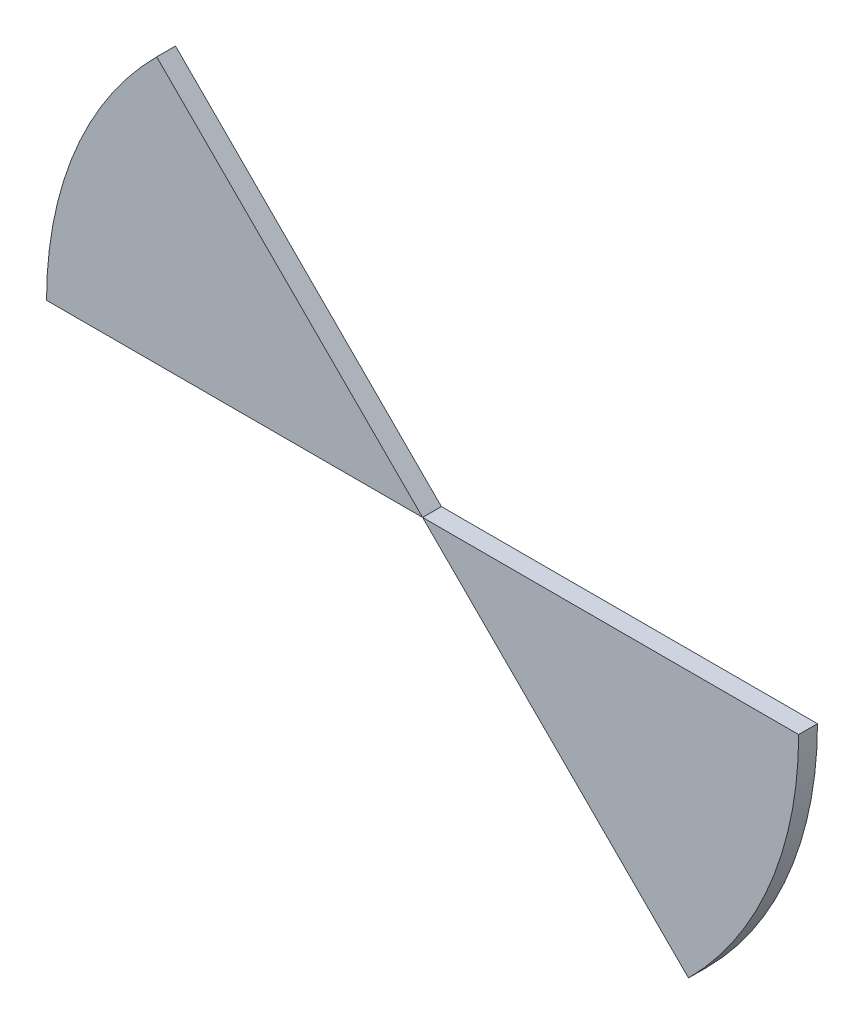
ISO-10303-21;
HEADER;
FILE_DESCRIPTION(('STEP AP214'),'2;1');
FILE_NAME('part.step','',(''),(''),'','','');
FILE_SCHEMA(('AUTOMOTIVE_DESIGN { 1 0 10303 214 1 1 1 1 }'));
ENDSEC;
DATA;
#1=APPLICATION_CONTEXT('core data for automotive mechanical design processes');
#2=APPLICATION_PROTOCOL_DEFINITION('international standard','automotive_design',2000,#1);
#3=PRODUCT_CONTEXT('',#1,'mechanical');
#4=PRODUCT('Part','Part','',(#3));
#5=PRODUCT_RELATED_PRODUCT_CATEGORY('part','',(#4));
#6=PRODUCT_DEFINITION_FORMATION('','',#4);
#7=PRODUCT_DEFINITION_CONTEXT('part definition',#1,'design');
#8=PRODUCT_DEFINITION('design','',#6,#7);
#9=PRODUCT_DEFINITION_SHAPE('','',#8);
#10=(LENGTH_UNIT() NAMED_UNIT(*) SI_UNIT(.MILLI.,.METRE.));
#11=(NAMED_UNIT(*) PLANE_ANGLE_UNIT() SI_UNIT($,.RADIAN.));
#12=(NAMED_UNIT(*) SI_UNIT($,.STERADIAN.) SOLID_ANGLE_UNIT());
#13=UNCERTAINTY_MEASURE_WITH_UNIT(LENGTH_MEASURE(1.E-05),#10,'distance_accuracy_value','');
#14=(GEOMETRIC_REPRESENTATION_CONTEXT(3) GLOBAL_UNCERTAINTY_ASSIGNED_CONTEXT((#13)) GLOBAL_UNIT_ASSIGNED_CONTEXT((#10,
#11,#12)) REPRESENTATION_CONTEXT('',''));
#15=CARTESIAN_POINT('',(0.,0.,0.));
#16=DIRECTION('',(0.,0.,1.));
#17=DIRECTION('',(1.,0.,0.));
#18=AXIS2_PLACEMENT_3D('',#15,#16,#17);
#19=CARTESIAN_POINT('',(100.,0.,127.474487139159));
#20=DIRECTION('',(0.,-1.,0.));
#21=DIRECTION('',(0.,0.,-1.));
#22=AXIS2_PLACEMENT_3D('',#19,#20,#21);
#23=PLANE('',#22);
#24=DIRECTION('',(-1.,0.,0.));
#25=VECTOR('',#24,1.);
#26=CARTESIAN_POINT('',(100.,0.,5.));
#27=LINE('',#26,#25);
#28=CARTESIAN_POINT('',(100.,0.,5.));
#29=VERTEX_POINT('',#28);
#30=CARTESIAN_POINT('',(0.,0.,5.));
#31=VERTEX_POINT('',#30);
#32=EDGE_CURVE('E58',#29,#31,#27,.T.);
#33=ORIENTED_EDGE('',*,*,#32,.F.);
#34=DIRECTION('',(0.,0.,-1.));
#35=VECTOR('',#34,1.);
#36=CARTESIAN_POINT('',(100.,0.,127.474487139159));
#37=LINE('',#36,#35);
#38=CARTESIAN_POINT('',(100.,0.,0.));
#39=VERTEX_POINT('',#38);
#40=EDGE_CURVE('E54',#29,#39,#37,.T.);
#41=ORIENTED_EDGE('',*,*,#40,.T.);
#42=DIRECTION('',(-1.,0.,0.));
#43=VECTOR('',#42,1.);
#44=CARTESIAN_POINT('',(100.,0.,0.));
#45=LINE('',#44,#43);
#46=CARTESIAN_POINT('',(0.,0.,0.));
#47=VERTEX_POINT('',#46);
#48=EDGE_CURVE('E89',#39,#47,#45,.T.);
#49=ORIENTED_EDGE('',*,*,#48,.T.);
#50=DIRECTION('',(0.,0.,-1.));
#51=VECTOR('',#50,1.);
#52=CARTESIAN_POINT('',(0.,0.,127.474487139159));
#53=LINE('',#52,#51);
#54=EDGE_CURVE('E81',#31,#47,#53,.T.);
#55=ORIENTED_EDGE('',*,*,#54,.F.);
#56=EDGE_LOOP('',(#33,#41,#49,#55));
#57=FACE_BOUND('',#56,.T.);
#58=ADVANCED_FACE('F51',(#57),#23,.F.);
#59=CARTESIAN_POINT('',(0.,0.,127.474487139159));
#60=DIRECTION('',(0.707106781186544,0.707106781186551,0.));
#61=DIRECTION('',(-0.707106781186551,0.707106781186544,0.));
#62=AXIS2_PLACEMENT_3D('',#59,#60,#61);
#63=PLANE('',#62);
#64=DIRECTION('',(0.707106781186551,-0.707106781186544,0.));
#65=VECTOR('',#64,1.);
#66=CARTESIAN_POINT('',(0.,0.,5.));
#67=LINE('',#66,#65);
#68=CARTESIAN_POINT('',(70.7106781186551,-70.7106781186544,5.));
#69=VERTEX_POINT('',#68);
#70=EDGE_CURVE('E12',#31,#69,#67,.T.);
#71=ORIENTED_EDGE('',*,*,#70,.F.);
#72=ORIENTED_EDGE('',*,*,#54,.T.);
#73=DIRECTION('',(0.707106781186551,-0.707106781186544,0.));
#74=VECTOR('',#73,1.);
#75=CARTESIAN_POINT('',(0.,0.,0.));
#76=LINE('',#75,#74);
#77=CARTESIAN_POINT('',(70.7106781186551,-70.7106781186544,0.));
#78=VERTEX_POINT('',#77);
#79=EDGE_CURVE('E99',#47,#78,#76,.T.);
#80=ORIENTED_EDGE('',*,*,#79,.T.);
#81=DIRECTION('',(0.,0.,-1.));
#82=VECTOR('',#81,1.);
#83=CARTESIAN_POINT('',(70.7106781186551,-70.7106781186544,127.474487139159));
#84=LINE('',#83,#82);
#85=EDGE_CURVE('E71',#69,#78,#84,.T.);
#86=ORIENTED_EDGE('',*,*,#85,.F.);
#87=EDGE_LOOP('',(#71,#72,#80,#86));
#88=FACE_BOUND('',#87,.T.);
#89=ADVANCED_FACE('F106',(#88),#63,.F.);
#90=CARTESIAN_POINT('',(0.,0.,127.474487139159));
#91=DIRECTION('',(0.,0.,-1.));
#92=DIRECTION('',(-1.,0.,0.));
#93=AXIS2_PLACEMENT_3D('',#90,#91,#92);
#94=CYLINDRICAL_SURFACE('',#93,100.);
#95=CARTESIAN_POINT('',(0.,0.,5.));
#96=DIRECTION('',(0.,0.,1.));
#97=DIRECTION('',(1.,0.,0.));
#98=AXIS2_PLACEMENT_3D('',#95,#96,#97);
#99=CIRCLE('',#98,100.);
#100=EDGE_CURVE('E100',#69,#29,#99,.T.);
#101=ORIENTED_EDGE('',*,*,#100,.F.);
#102=ORIENTED_EDGE('',*,*,#85,.T.);
#103=CARTESIAN_POINT('',(0.,0.,0.));
#104=DIRECTION('',(0.,0.,1.));
#105=DIRECTION('',(1.,0.,0.));
#106=AXIS2_PLACEMENT_3D('',#103,#104,#105);
#107=CIRCLE('',#106,100.);
#108=EDGE_CURVE('E94',#78,#39,#107,.T.);
#109=ORIENTED_EDGE('',*,*,#108,.T.);
#110=ORIENTED_EDGE('',*,*,#40,.F.);
#111=EDGE_LOOP('',(#101,#102,#109,#110));
#112=FACE_BOUND('',#111,.T.);
#113=ADVANCED_FACE('F92',(#112),#94,.T.);
#114=CARTESIAN_POINT('',(0.,0.,0.));
#115=DIRECTION('',(0.,0.,1.));
#116=DIRECTION('',(1.,0.,0.));
#117=AXIS2_PLACEMENT_3D('',#114,#115,#116);
#118=PLANE('',#117);
#119=ORIENTED_EDGE('',*,*,#48,.F.);
#120=ORIENTED_EDGE('',*,*,#108,.F.);
#121=ORIENTED_EDGE('',*,*,#79,.F.);
#122=EDGE_LOOP('',(#119,#120,#121));
#123=FACE_BOUND('',#122,.T.);
#124=ADVANCED_FACE('F97',(#123),#118,.F.);
#125=CARTESIAN_POINT('',(0.,0.,5.));
#126=DIRECTION('',(0.,0.,1.));
#127=DIRECTION('',(1.,0.,0.));
#128=AXIS2_PLACEMENT_3D('',#125,#126,#127);
#129=PLANE('',#128);
#130=ORIENTED_EDGE('',*,*,#100,.T.);
#131=ORIENTED_EDGE('',*,*,#32,.T.);
#132=ORIENTED_EDGE('',*,*,#70,.T.);
#133=EDGE_LOOP('',(#130,#131,#132));
#134=FACE_BOUND('',#133,.T.);
#135=ADVANCED_FACE('F52',(#134),#129,.T.);
#136=CLOSED_SHELL('',(#58,#89,#113,#124,#135));
#137=MANIFOLD_SOLID_BREP('B2',#136);
#138=CARTESIAN_POINT('',(0.,0.,5.));
#139=DIRECTION('',(0.,0.,-1.));
#140=DIRECTION('',(-1.,0.,0.));
#141=AXIS2_PLACEMENT_3D('',#138,#139,#140);
#142=CYLINDRICAL_SURFACE('',#141,100.);
#143=CARTESIAN_POINT('',(0.,0.,0.));
#144=DIRECTION('',(0.,0.,1.));
#145=DIRECTION('',(1.,0.,0.));
#146=AXIS2_PLACEMENT_3D('',#143,#144,#145);
#147=CIRCLE('',#146,100.);
#148=CARTESIAN_POINT('',(-70.7106781186551,70.7106781186544,0.));
#149=VERTEX_POINT('',#148);
#150=CARTESIAN_POINT('',(-100.,0.,0.));
#151=VERTEX_POINT('',#150);
#152=EDGE_CURVE('E198',#149,#151,#147,.T.);
#153=ORIENTED_EDGE('',*,*,#152,.T.);
#154=DIRECTION('',(0.,0.,-1.));
#155=VECTOR('',#154,1.);
#156=CARTESIAN_POINT('',(-100.,0.,5.));
#157=LINE('',#156,#155);
#158=CARTESIAN_POINT('',(-100.,0.,5.));
#159=VERTEX_POINT('',#158);
#160=EDGE_CURVE('E47',#159,#151,#157,.T.);
#161=ORIENTED_EDGE('',*,*,#160,.F.);
#162=CARTESIAN_POINT('',(0.,0.,5.));
#163=DIRECTION('',(0.,0.,1.));
#164=DIRECTION('',(1.,0.,0.));
#165=AXIS2_PLACEMENT_3D('',#162,#163,#164);
#166=CIRCLE('',#165,100.);
#167=CARTESIAN_POINT('',(-70.7106781186551,70.7106781186544,5.));
#168=VERTEX_POINT('',#167);
#169=EDGE_CURVE('E188',#168,#159,#166,.T.);
#170=ORIENTED_EDGE('',*,*,#169,.F.);
#171=DIRECTION('',(0.,0.,-1.));
#172=VECTOR('',#171,1.);
#173=CARTESIAN_POINT('',(-70.7106781186551,70.7106781186544,5.));
#174=LINE('',#173,#172);
#175=EDGE_CURVE('E197',#168,#149,#174,.T.);
#176=ORIENTED_EDGE('',*,*,#175,.T.);
#177=EDGE_LOOP('',(#153,#161,#170,#176));
#178=FACE_BOUND('',#177,.T.);
#179=ADVANCED_FACE('F149',(#178),#142,.T.);
#180=CARTESIAN_POINT('',(-100.,0.,5.));
#181=DIRECTION('',(0.,1.,0.));
#182=DIRECTION('',(0.,0.,1.));
#183=AXIS2_PLACEMENT_3D('',#180,#181,#182);
#184=PLANE('',#183);
#185=DIRECTION('',(1.,0.,0.));
#186=VECTOR('',#185,1.);
#187=CARTESIAN_POINT('',(-100.,0.,0.));
#188=LINE('',#187,#186);
#189=CARTESIAN_POINT('',(0.,0.,0.));
#190=VERTEX_POINT('',#189);
#191=EDGE_CURVE('E180',#151,#190,#188,.T.);
#192=ORIENTED_EDGE('',*,*,#191,.T.);
#193=DIRECTION('',(0.,0.,-1.));
#194=VECTOR('',#193,1.);
#195=CARTESIAN_POINT('',(0.,0.,5.));
#196=LINE('',#195,#194);
#197=CARTESIAN_POINT('',(0.,0.,5.));
#198=VERTEX_POINT('',#197);
#199=EDGE_CURVE('E160',#198,#190,#196,.T.);
#200=ORIENTED_EDGE('',*,*,#199,.F.);
#201=DIRECTION('',(1.,0.,0.));
#202=VECTOR('',#201,1.);
#203=CARTESIAN_POINT('',(-100.,0.,5.));
#204=LINE('',#203,#202);
#205=EDGE_CURVE('E183',#159,#198,#204,.T.);
#206=ORIENTED_EDGE('',*,*,#205,.F.);
#207=ORIENTED_EDGE('',*,*,#160,.T.);
#208=EDGE_LOOP('',(#192,#200,#206,#207));
#209=FACE_BOUND('',#208,.T.);
#210=ADVANCED_FACE('F189',(#209),#184,.F.);
#211=CARTESIAN_POINT('',(0.,0.,5.));
#212=DIRECTION('',(-0.707106781186544,-0.707106781186551,0.));
#213=DIRECTION('',(0.707106781186551,-0.707106781186544,0.));
#214=AXIS2_PLACEMENT_3D('',#211,#212,#213);
#215=PLANE('',#214);
#216=DIRECTION('',(-0.707106781186551,0.707106781186544,0.));
#217=VECTOR('',#216,1.);
#218=CARTESIAN_POINT('',(0.,0.,0.));
#219=LINE('',#218,#217);
#220=EDGE_CURVE('E185',#190,#149,#219,.T.);
#221=ORIENTED_EDGE('',*,*,#220,.T.);
#222=ORIENTED_EDGE('',*,*,#175,.F.);
#223=DIRECTION('',(-0.707106781186551,0.707106781186544,0.));
#224=VECTOR('',#223,1.);
#225=CARTESIAN_POINT('',(0.,0.,5.));
#226=LINE('',#225,#224);
#227=EDGE_CURVE('E164',#198,#168,#226,.T.);
#228=ORIENTED_EDGE('',*,*,#227,.F.);
#229=ORIENTED_EDGE('',*,*,#199,.T.);
#230=EDGE_LOOP('',(#221,#222,#228,#229));
#231=FACE_BOUND('',#230,.T.);
#232=ADVANCED_FACE('F204',(#231),#215,.F.);
#233=CARTESIAN_POINT('',(0.,0.,5.));
#234=DIRECTION('',(0.,0.,1.));
#235=DIRECTION('',(1.,0.,0.));
#236=AXIS2_PLACEMENT_3D('',#233,#234,#235);
#237=PLANE('',#236);
#238=ORIENTED_EDGE('',*,*,#169,.T.);
#239=ORIENTED_EDGE('',*,*,#205,.T.);
#240=ORIENTED_EDGE('',*,*,#227,.T.);
#241=EDGE_LOOP('',(#238,#239,#240));
#242=FACE_BOUND('',#241,.T.);
#243=ADVANCED_FACE('F195',(#242),#237,.T.);
#244=CARTESIAN_POINT('',(0.,0.,0.));
#245=DIRECTION('',(0.,0.,1.));
#246=DIRECTION('',(1.,0.,0.));
#247=AXIS2_PLACEMENT_3D('',#244,#245,#246);
#248=PLANE('',#247);
#249=ORIENTED_EDGE('',*,*,#152,.F.);
#250=ORIENTED_EDGE('',*,*,#220,.F.);
#251=ORIENTED_EDGE('',*,*,#191,.F.);
#252=EDGE_LOOP('',(#249,#250,#251));
#253=FACE_BOUND('',#252,.T.);
#254=ADVANCED_FACE('F202',(#253),#248,.F.);
#255=CLOSED_SHELL('',(#179,#210,#232,#243,#254));
#256=MANIFOLD_SOLID_BREP('B6',#255);
#257=ADVANCED_BREP_SHAPE_REPRESENTATION('',(#18,#137,#256),#14);
#258=SHAPE_DEFINITION_REPRESENTATION(#9,#257);
ENDSEC;
END-ISO-10303-21;
